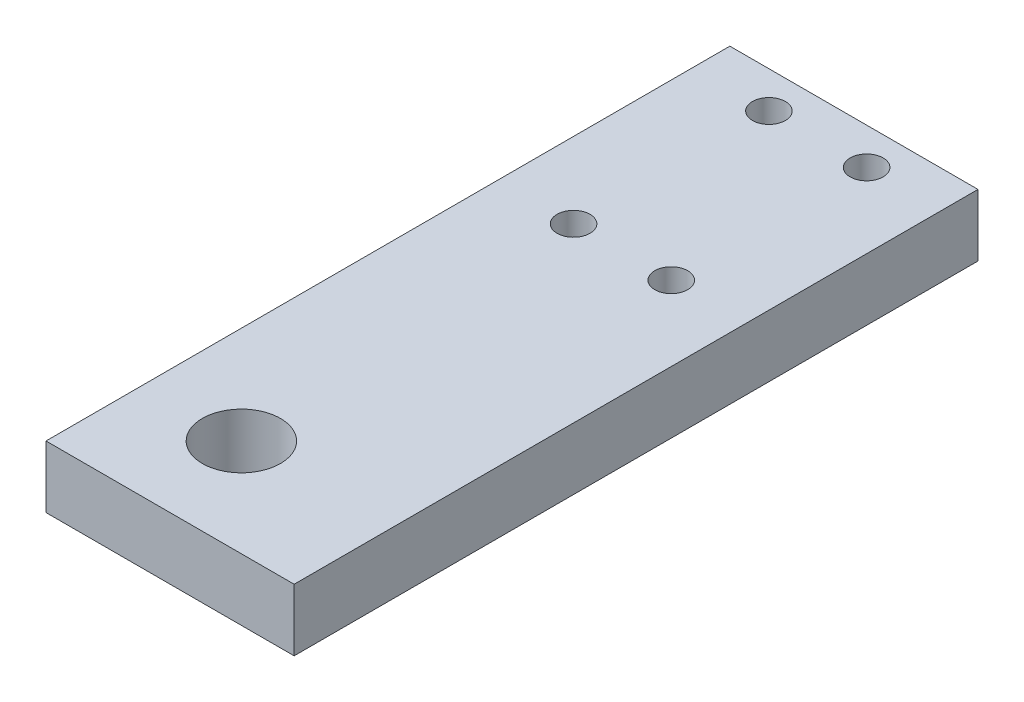
ISO-10303-21;
HEADER;
FILE_DESCRIPTION(('STEP AP214'),'2;1');
FILE_NAME('part.step','',(''),(''),'','','');
FILE_SCHEMA(('AUTOMOTIVE_DESIGN { 1 0 10303 214 1 1 1 1 }'));
ENDSEC;
DATA;
#1=APPLICATION_CONTEXT('core data for automotive mechanical design processes');
#2=APPLICATION_PROTOCOL_DEFINITION('international standard','automotive_design',2000,#1);
#3=PRODUCT_CONTEXT('',#1,'mechanical');
#4=PRODUCT('Part','Part','',(#3));
#5=PRODUCT_RELATED_PRODUCT_CATEGORY('part','',(#4));
#6=PRODUCT_DEFINITION_FORMATION('','',#4);
#7=PRODUCT_DEFINITION_CONTEXT('part definition',#1,'design');
#8=PRODUCT_DEFINITION('design','',#6,#7);
#9=PRODUCT_DEFINITION_SHAPE('','',#8);
#10=(LENGTH_UNIT() NAMED_UNIT(*) SI_UNIT(.MILLI.,.METRE.));
#11=(NAMED_UNIT(*) PLANE_ANGLE_UNIT() SI_UNIT($,.RADIAN.));
#12=(NAMED_UNIT(*) SI_UNIT($,.STERADIAN.) SOLID_ANGLE_UNIT());
#13=UNCERTAINTY_MEASURE_WITH_UNIT(LENGTH_MEASURE(1.E-05),#10,'distance_accuracy_value','');
#14=(GEOMETRIC_REPRESENTATION_CONTEXT(3) GLOBAL_UNCERTAINTY_ASSIGNED_CONTEXT((#13)) GLOBAL_UNIT_ASSIGNED_CONTEXT((#10,
#11,#12)) REPRESENTATION_CONTEXT('',''));
#15=CARTESIAN_POINT('',(0.,0.,0.));
#16=DIRECTION('',(0.,0.,1.));
#17=DIRECTION('',(1.,0.,0.));
#18=AXIS2_PLACEMENT_3D('',#15,#16,#17);
#19=CARTESIAN_POINT('',(0.,25.4,0.));
#20=DIRECTION('',(1.,0.,0.));
#21=DIRECTION('',(0.,0.,-1.));
#22=AXIS2_PLACEMENT_3D('',#19,#20,#21);
#23=PLANE('',#22);
#24=DIRECTION('',(0.,0.,1.));
#25=VECTOR('',#24,1.);
#26=CARTESIAN_POINT('',(0.,0.,0.));
#27=LINE('',#26,#25);
#28=CARTESIAN_POINT('',(0.,0.,-280.));
#29=VERTEX_POINT('',#28);
#30=CARTESIAN_POINT('',(0.,0.,0.));
#31=VERTEX_POINT('',#30);
#32=EDGE_CURVE('E94',#29,#31,#27,.T.);
#33=ORIENTED_EDGE('',*,*,#32,.T.);
#34=DIRECTION('',(0.,-1.,0.));
#35=VECTOR('',#34,1.);
#36=CARTESIAN_POINT('',(0.,25.4,0.));
#37=LINE('',#36,#35);
#38=CARTESIAN_POINT('',(0.,25.4,0.));
#39=VERTEX_POINT('',#38);
#40=EDGE_CURVE('E11',#39,#31,#37,.T.);
#41=ORIENTED_EDGE('',*,*,#40,.F.);
#42=DIRECTION('',(0.,0.,1.));
#43=VECTOR('',#42,1.);
#44=CARTESIAN_POINT('',(0.,25.4,0.));
#45=LINE('',#44,#43);
#46=CARTESIAN_POINT('',(0.,25.4,-280.));
#47=VERTEX_POINT('',#46);
#48=EDGE_CURVE('E82',#47,#39,#45,.T.);
#49=ORIENTED_EDGE('',*,*,#48,.F.);
#50=DIRECTION('',(0.,-1.,0.));
#51=VECTOR('',#50,1.);
#52=CARTESIAN_POINT('',(0.,25.4,-280.));
#53=LINE('',#52,#51);
#54=EDGE_CURVE('E90',#47,#29,#53,.T.);
#55=ORIENTED_EDGE('',*,*,#54,.T.);
#56=EDGE_LOOP('',(#33,#41,#49,#55));
#57=FACE_BOUND('',#56,.T.);
#58=ADVANCED_FACE('F31',(#57),#23,.F.);
#59=CARTESIAN_POINT('',(0.,25.4,0.));
#60=DIRECTION('',(0.,0.,-1.));
#61=DIRECTION('',(-1.,0.,0.));
#62=AXIS2_PLACEMENT_3D('',#59,#60,#61);
#63=PLANE('',#62);
#64=DIRECTION('',(1.,0.,0.));
#65=VECTOR('',#64,1.);
#66=CARTESIAN_POINT('',(0.,0.,0.));
#67=LINE('',#66,#65);
#68=CARTESIAN_POINT('',(101.6,0.,0.));
#69=VERTEX_POINT('',#68);
#70=EDGE_CURVE('E86',#31,#69,#67,.T.);
#71=ORIENTED_EDGE('',*,*,#70,.T.);
#72=DIRECTION('',(0.,-1.,0.));
#73=VECTOR('',#72,1.);
#74=CARTESIAN_POINT('',(101.6,25.4,0.));
#75=LINE('',#74,#73);
#76=CARTESIAN_POINT('',(101.6,25.4,0.));
#77=VERTEX_POINT('',#76);
#78=EDGE_CURVE('E39',#77,#69,#75,.T.);
#79=ORIENTED_EDGE('',*,*,#78,.F.);
#80=DIRECTION('',(1.,0.,0.));
#81=VECTOR('',#80,1.);
#82=CARTESIAN_POINT('',(0.,25.4,0.));
#83=LINE('',#82,#81);
#84=EDGE_CURVE('E77',#39,#77,#83,.T.);
#85=ORIENTED_EDGE('',*,*,#84,.F.);
#86=ORIENTED_EDGE('',*,*,#40,.T.);
#87=EDGE_LOOP('',(#71,#79,#85,#86));
#88=FACE_BOUND('',#87,.T.);
#89=ADVANCED_FACE('F85',(#88),#63,.F.);
#90=CARTESIAN_POINT('',(101.6,25.4,0.));
#91=DIRECTION('',(-1.,0.,0.));
#92=DIRECTION('',(0.,0.,1.));
#93=AXIS2_PLACEMENT_3D('',#90,#91,#92);
#94=PLANE('',#93);
#95=DIRECTION('',(0.,0.,-1.));
#96=VECTOR('',#95,1.);
#97=CARTESIAN_POINT('',(101.6,0.,0.));
#98=LINE('',#97,#96);
#99=CARTESIAN_POINT('',(101.6,0.,-280.));
#100=VERTEX_POINT('',#99);
#101=EDGE_CURVE('E64',#69,#100,#98,.T.);
#102=ORIENTED_EDGE('',*,*,#101,.T.);
#103=DIRECTION('',(0.,-1.,0.));
#104=VECTOR('',#103,1.);
#105=CARTESIAN_POINT('',(101.6,25.4,-280.));
#106=LINE('',#105,#104);
#107=CARTESIAN_POINT('',(101.6,25.4,-280.));
#108=VERTEX_POINT('',#107);
#109=EDGE_CURVE('E87',#108,#100,#106,.T.);
#110=ORIENTED_EDGE('',*,*,#109,.F.);
#111=DIRECTION('',(0.,0.,-1.));
#112=VECTOR('',#111,1.);
#113=CARTESIAN_POINT('',(101.6,25.4,0.));
#114=LINE('',#113,#112);
#115=EDGE_CURVE('E80',#77,#108,#114,.T.);
#116=ORIENTED_EDGE('',*,*,#115,.F.);
#117=ORIENTED_EDGE('',*,*,#78,.T.);
#118=EDGE_LOOP('',(#102,#110,#116,#117));
#119=FACE_BOUND('',#118,.T.);
#120=ADVANCED_FACE('F88',(#119),#94,.F.);
#121=CARTESIAN_POINT('',(0.,25.4,-280.));
#122=DIRECTION('',(0.,0.,1.));
#123=DIRECTION('',(1.,0.,0.));
#124=AXIS2_PLACEMENT_3D('',#121,#122,#123);
#125=PLANE('',#124);
#126=DIRECTION('',(-1.,0.,0.));
#127=VECTOR('',#126,1.);
#128=CARTESIAN_POINT('',(0.,0.,-280.));
#129=LINE('',#128,#127);
#130=EDGE_CURVE('E70',#100,#29,#129,.T.);
#131=ORIENTED_EDGE('',*,*,#130,.T.);
#132=ORIENTED_EDGE('',*,*,#54,.F.);
#133=DIRECTION('',(-1.,0.,0.));
#134=VECTOR('',#133,1.);
#135=CARTESIAN_POINT('',(0.,25.4,-280.));
#136=LINE('',#135,#134);
#137=EDGE_CURVE('E47',#108,#47,#136,.T.);
#138=ORIENTED_EDGE('',*,*,#137,.F.);
#139=ORIENTED_EDGE('',*,*,#109,.T.);
#140=EDGE_LOOP('',(#131,#132,#138,#139));
#141=FACE_BOUND('',#140,.T.);
#142=ADVANCED_FACE('F102',(#141),#125,.F.);
#143=CARTESIAN_POINT('',(0.,25.4,-280.));
#144=DIRECTION('',(0.,-1.,0.));
#145=DIRECTION('',(0.,0.,-1.));
#146=AXIS2_PLACEMENT_3D('',#143,#144,#145);
#147=PLANE('',#146);
#148=CARTESIAN_POINT('',(40.,25.4,-40.));
#149=DIRECTION('',(0.,1.,0.));
#150=DIRECTION('',(0.,0.,1.));
#151=AXIS2_PLACEMENT_3D('',#148,#149,#150);
#152=CIRCLE('',#151,16.);
#153=CARTESIAN_POINT('',(40.,25.4,-24.));
#154=VERTEX_POINT('',#153);
#155=EDGE_CURVE('E132',#154,#154,#152,.T.);
#156=ORIENTED_EDGE('',*,*,#155,.F.);
#157=EDGE_LOOP('',(#156));
#158=FACE_BOUND('',#157,.T.);
#159=CARTESIAN_POINT('',(31.,25.4,-185.));
#160=DIRECTION('',(0.,1.,0.));
#161=DIRECTION('',(0.,0.,1.));
#162=AXIS2_PLACEMENT_3D('',#159,#160,#161);
#163=CIRCLE('',#162,6.75);
#164=CARTESIAN_POINT('',(31.,25.4,-178.25));
#165=VERTEX_POINT('',#164);
#166=EDGE_CURVE('E123',#165,#165,#163,.T.);
#167=ORIENTED_EDGE('',*,*,#166,.F.);
#168=EDGE_LOOP('',(#167));
#169=FACE_BOUND('',#168,.T.);
#170=CARTESIAN_POINT('',(71.,25.4,-185.));
#171=DIRECTION('',(0.,1.,0.));
#172=DIRECTION('',(0.,0.,1.));
#173=AXIS2_PLACEMENT_3D('',#170,#171,#172);
#174=CIRCLE('',#173,6.75);
#175=CARTESIAN_POINT('',(71.,25.4,-178.25));
#176=VERTEX_POINT('',#175);
#177=EDGE_CURVE('E117',#176,#176,#174,.T.);
#178=ORIENTED_EDGE('',*,*,#177,.F.);
#179=EDGE_LOOP('',(#178));
#180=FACE_BOUND('',#179,.T.);
#181=CARTESIAN_POINT('',(71.,25.4,-265.));
#182=DIRECTION('',(0.,1.,0.));
#183=DIRECTION('',(0.,0.,1.));
#184=AXIS2_PLACEMENT_3D('',#181,#182,#183);
#185=CIRCLE('',#184,6.75);
#186=CARTESIAN_POINT('',(71.,25.4,-258.25));
#187=VERTEX_POINT('',#186);
#188=EDGE_CURVE('E111',#187,#187,#185,.T.);
#189=ORIENTED_EDGE('',*,*,#188,.F.);
#190=EDGE_LOOP('',(#189));
#191=FACE_BOUND('',#190,.T.);
#192=CARTESIAN_POINT('',(31.,25.4,-265.));
#193=DIRECTION('',(0.,1.,0.));
#194=DIRECTION('',(0.,0.,1.));
#195=AXIS2_PLACEMENT_3D('',#192,#193,#194);
#196=CIRCLE('',#195,6.75);
#197=CARTESIAN_POINT('',(31.,25.4,-258.25));
#198=VERTEX_POINT('',#197);
#199=EDGE_CURVE('E108',#198,#198,#196,.T.);
#200=ORIENTED_EDGE('',*,*,#199,.F.);
#201=EDGE_LOOP('',(#200));
#202=FACE_BOUND('',#201,.T.);
#203=ORIENTED_EDGE('',*,*,#48,.T.);
#204=ORIENTED_EDGE('',*,*,#84,.T.);
#205=ORIENTED_EDGE('',*,*,#115,.T.);
#206=ORIENTED_EDGE('',*,*,#137,.T.);
#207=EDGE_LOOP('',(#203,#204,#205,#206));
#208=FACE_BOUND('',#207,.T.);
#209=ADVANCED_FACE('F78',(#158,#169,#180,#191,#202,#208),#147,.F.);
#210=CARTESIAN_POINT('',(0.,0.,-280.));
#211=DIRECTION('',(0.,-1.,0.));
#212=DIRECTION('',(0.,0.,-1.));
#213=AXIS2_PLACEMENT_3D('',#210,#211,#212);
#214=PLANE('',#213);
#215=CARTESIAN_POINT('',(40.,0.,-40.));
#216=DIRECTION('',(0.,1.,0.));
#217=DIRECTION('',(0.,0.,1.));
#218=AXIS2_PLACEMENT_3D('',#215,#216,#217);
#219=CIRCLE('',#218,16.);
#220=CARTESIAN_POINT('',(40.,0.,-24.));
#221=VERTEX_POINT('',#220);
#222=EDGE_CURVE('E129',#221,#221,#219,.T.);
#223=ORIENTED_EDGE('',*,*,#222,.T.);
#224=EDGE_LOOP('',(#223));
#225=FACE_BOUND('',#224,.T.);
#226=CARTESIAN_POINT('',(31.,0.,-185.));
#227=DIRECTION('',(0.,1.,0.));
#228=DIRECTION('',(0.,0.,1.));
#229=AXIS2_PLACEMENT_3D('',#226,#227,#228);
#230=CIRCLE('',#229,6.75);
#231=CARTESIAN_POINT('',(31.,0.,-178.25));
#232=VERTEX_POINT('',#231);
#233=EDGE_CURVE('E126',#232,#232,#230,.T.);
#234=ORIENTED_EDGE('',*,*,#233,.T.);
#235=EDGE_LOOP('',(#234));
#236=FACE_BOUND('',#235,.T.);
#237=CARTESIAN_POINT('',(71.,0.,-185.));
#238=DIRECTION('',(0.,1.,0.));
#239=DIRECTION('',(0.,0.,1.));
#240=AXIS2_PLACEMENT_3D('',#237,#238,#239);
#241=CIRCLE('',#240,6.75);
#242=CARTESIAN_POINT('',(71.,0.,-178.25));
#243=VERTEX_POINT('',#242);
#244=EDGE_CURVE('E120',#243,#243,#241,.T.);
#245=ORIENTED_EDGE('',*,*,#244,.T.);
#246=EDGE_LOOP('',(#245));
#247=FACE_BOUND('',#246,.T.);
#248=CARTESIAN_POINT('',(71.,0.,-265.));
#249=DIRECTION('',(0.,1.,0.));
#250=DIRECTION('',(0.,0.,1.));
#251=AXIS2_PLACEMENT_3D('',#248,#249,#250);
#252=CIRCLE('',#251,6.75);
#253=CARTESIAN_POINT('',(71.,0.,-258.25));
#254=VERTEX_POINT('',#253);
#255=EDGE_CURVE('E114',#254,#254,#252,.T.);
#256=ORIENTED_EDGE('',*,*,#255,.T.);
#257=EDGE_LOOP('',(#256));
#258=FACE_BOUND('',#257,.T.);
#259=CARTESIAN_POINT('',(31.,0.,-265.));
#260=DIRECTION('',(0.,1.,0.));
#261=DIRECTION('',(0.,0.,1.));
#262=AXIS2_PLACEMENT_3D('',#259,#260,#261);
#263=CIRCLE('',#262,6.75);
#264=CARTESIAN_POINT('',(31.,0.,-258.25));
#265=VERTEX_POINT('',#264);
#266=EDGE_CURVE('E97',#265,#265,#263,.T.);
#267=ORIENTED_EDGE('',*,*,#266,.T.);
#268=EDGE_LOOP('',(#267));
#269=FACE_BOUND('',#268,.T.);
#270=ORIENTED_EDGE('',*,*,#32,.F.);
#271=ORIENTED_EDGE('',*,*,#130,.F.);
#272=ORIENTED_EDGE('',*,*,#101,.F.);
#273=ORIENTED_EDGE('',*,*,#70,.F.);
#274=EDGE_LOOP('',(#270,#271,#272,#273));
#275=FACE_BOUND('',#274,.T.);
#276=ADVANCED_FACE('F105',(#225,#236,#247,#258,#269,#275),#214,.T.);
#277=CARTESIAN_POINT('',(31.,0.,-265.));
#278=DIRECTION('',(0.,1.,0.));
#279=DIRECTION('',(0.,0.,1.));
#280=AXIS2_PLACEMENT_3D('',#277,#278,#279);
#281=CYLINDRICAL_SURFACE('',#280,6.75);
#282=ORIENTED_EDGE('',*,*,#266,.F.);
#283=EDGE_LOOP('',(#282));
#284=FACE_BOUND('',#283,.T.);
#285=ORIENTED_EDGE('',*,*,#199,.T.);
#286=EDGE_LOOP('',(#285));
#287=FACE_BOUND('',#286,.T.);
#288=ADVANCED_FACE('F158',(#284,#287),#281,.F.);
#289=CARTESIAN_POINT('',(71.,0.,-265.));
#290=DIRECTION('',(0.,1.,0.));
#291=DIRECTION('',(0.,0.,1.));
#292=AXIS2_PLACEMENT_3D('',#289,#290,#291);
#293=CYLINDRICAL_SURFACE('',#292,6.75);
#294=ORIENTED_EDGE('',*,*,#255,.F.);
#295=EDGE_LOOP('',(#294));
#296=FACE_BOUND('',#295,.T.);
#297=ORIENTED_EDGE('',*,*,#188,.T.);
#298=EDGE_LOOP('',(#297));
#299=FACE_BOUND('',#298,.T.);
#300=ADVANCED_FACE('F160',(#296,#299),#293,.F.);
#301=CARTESIAN_POINT('',(71.,0.,-185.));
#302=DIRECTION('',(0.,1.,0.));
#303=DIRECTION('',(0.,0.,1.));
#304=AXIS2_PLACEMENT_3D('',#301,#302,#303);
#305=CYLINDRICAL_SURFACE('',#304,6.75);
#306=ORIENTED_EDGE('',*,*,#244,.F.);
#307=EDGE_LOOP('',(#306));
#308=FACE_BOUND('',#307,.T.);
#309=ORIENTED_EDGE('',*,*,#177,.T.);
#310=EDGE_LOOP('',(#309));
#311=FACE_BOUND('',#310,.T.);
#312=ADVANCED_FACE('F167',(#308,#311),#305,.F.);
#313=CARTESIAN_POINT('',(31.,0.,-185.));
#314=DIRECTION('',(0.,1.,0.));
#315=DIRECTION('',(0.,0.,1.));
#316=AXIS2_PLACEMENT_3D('',#313,#314,#315);
#317=CYLINDRICAL_SURFACE('',#316,6.75);
#318=ORIENTED_EDGE('',*,*,#233,.F.);
#319=EDGE_LOOP('',(#318));
#320=FACE_BOUND('',#319,.T.);
#321=ORIENTED_EDGE('',*,*,#166,.T.);
#322=EDGE_LOOP('',(#321));
#323=FACE_BOUND('',#322,.T.);
#324=ADVANCED_FACE('F143',(#320,#323),#317,.F.);
#325=CARTESIAN_POINT('',(40.,0.,-40.));
#326=DIRECTION('',(0.,1.,0.));
#327=DIRECTION('',(0.,0.,1.));
#328=AXIS2_PLACEMENT_3D('',#325,#326,#327);
#329=CYLINDRICAL_SURFACE('',#328,16.);
#330=ORIENTED_EDGE('',*,*,#222,.F.);
#331=EDGE_LOOP('',(#330));
#332=FACE_BOUND('',#331,.T.);
#333=ORIENTED_EDGE('',*,*,#155,.T.);
#334=EDGE_LOOP('',(#333));
#335=FACE_BOUND('',#334,.T.);
#336=ADVANCED_FACE('F140',(#332,#335),#329,.F.);
#337=CLOSED_SHELL('',(#58,#89,#120,#142,#209,#276,#288,#300,#312,#324,#336));
#338=MANIFOLD_SOLID_BREP('B2',#337);
#339=ADVANCED_BREP_SHAPE_REPRESENTATION('',(#18,#338),#14);
#340=SHAPE_DEFINITION_REPRESENTATION(#9,#339);
ENDSEC;
END-ISO-10303-21;
